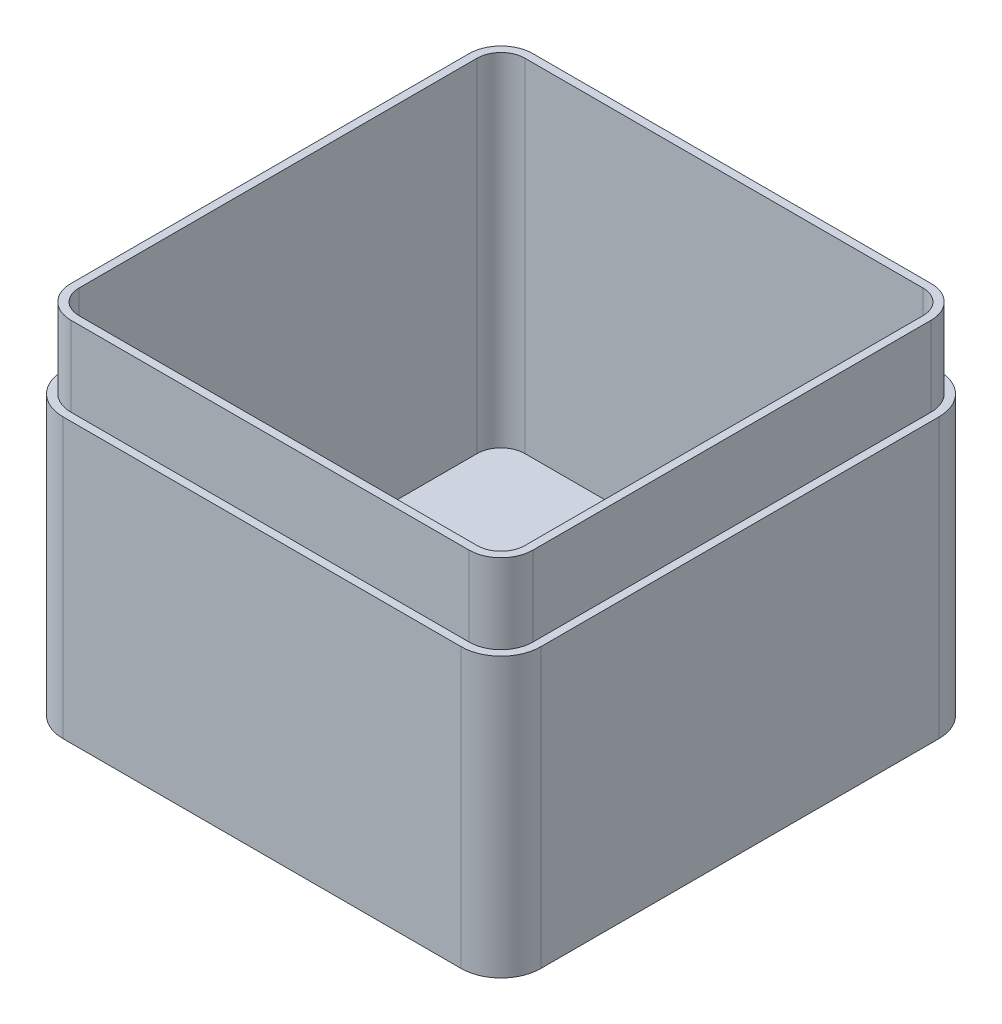
ISO-10303-21;
HEADER;
FILE_DESCRIPTION(('STEP AP214'),'2;1');
FILE_NAME('part.step','',(''),(''),'','','');
FILE_SCHEMA(('AUTOMOTIVE_DESIGN { 1 0 10303 214 1 1 1 1 }'));
ENDSEC;
DATA;
#1=APPLICATION_CONTEXT('core data for automotive mechanical design processes');
#2=APPLICATION_PROTOCOL_DEFINITION('international standard','automotive_design',2000,#1);
#3=PRODUCT_CONTEXT('',#1,'mechanical');
#4=PRODUCT('Part','Part','',(#3));
#5=PRODUCT_RELATED_PRODUCT_CATEGORY('part','',(#4));
#6=PRODUCT_DEFINITION_FORMATION('','',#4);
#7=PRODUCT_DEFINITION_CONTEXT('part definition',#1,'design');
#8=PRODUCT_DEFINITION('design','',#6,#7);
#9=PRODUCT_DEFINITION_SHAPE('','',#8);
#10=(LENGTH_UNIT() NAMED_UNIT(*) SI_UNIT(.MILLI.,.METRE.));
#11=(NAMED_UNIT(*) PLANE_ANGLE_UNIT() SI_UNIT($,.RADIAN.));
#12=(NAMED_UNIT(*) SI_UNIT($,.STERADIAN.) SOLID_ANGLE_UNIT());
#13=UNCERTAINTY_MEASURE_WITH_UNIT(LENGTH_MEASURE(1.E-05),#10,'distance_accuracy_value','');
#14=(GEOMETRIC_REPRESENTATION_CONTEXT(3) GLOBAL_UNCERTAINTY_ASSIGNED_CONTEXT((#13)) GLOBAL_UNIT_ASSIGNED_CONTEXT((#10,
#11,#12)) REPRESENTATION_CONTEXT('',''));
#15=CARTESIAN_POINT('',(0.,0.,0.));
#16=DIRECTION('',(0.,0.,1.));
#17=DIRECTION('',(1.,0.,0.));
#18=AXIS2_PLACEMENT_3D('',#15,#16,#17);
#19=CARTESIAN_POINT('',(0.,90.,0.));
#20=DIRECTION('',(0.,-1.,0.));
#21=DIRECTION('',(0.,0.,-1.));
#22=AXIS2_PLACEMENT_3D('',#19,#20,#21);
#23=PLANE('',#22);
#24=DIRECTION('',(-1.,0.,0.));
#25=VECTOR('',#24,1.);
#26=CARTESIAN_POINT('',(0.,90.,-56.));
#27=LINE('',#26,#25);
#28=CARTESIAN_POINT('',(50.,90.,-56.));
#29=VERTEX_POINT('',#28);
#30=CARTESIAN_POINT('',(-50.,90.,-56.));
#31=VERTEX_POINT('',#30);
#32=EDGE_CURVE('E343',#29,#31,#27,.T.);
#33=ORIENTED_EDGE('',*,*,#32,.F.);
#34=CARTESIAN_POINT('',(50.,90.,-50.));
#35=DIRECTION('',(0.,-1.,0.));
#36=DIRECTION('',(0.,0.,-1.));
#37=AXIS2_PLACEMENT_3D('',#34,#35,#36);
#38=CIRCLE('',#37,6.);
#39=CARTESIAN_POINT('',(56.,90.,-50.));
#40=VERTEX_POINT('',#39);
#41=EDGE_CURVE('E344',#40,#29,#38,.F.);
#42=ORIENTED_EDGE('',*,*,#41,.F.);
#43=DIRECTION('',(0.,0.,-1.));
#44=VECTOR('',#43,1.);
#45=CARTESIAN_POINT('',(56.,90.,0.));
#46=LINE('',#45,#44);
#47=CARTESIAN_POINT('',(56.,90.,50.));
#48=VERTEX_POINT('',#47);
#49=EDGE_CURVE('E324',#48,#40,#46,.T.);
#50=ORIENTED_EDGE('',*,*,#49,.F.);
#51=CARTESIAN_POINT('',(50.,90.,50.));
#52=DIRECTION('',(0.,-1.,0.));
#53=DIRECTION('',(0.,0.,-1.));
#54=AXIS2_PLACEMENT_3D('',#51,#52,#53);
#55=CIRCLE('',#54,6.);
#56=CARTESIAN_POINT('',(50.,90.,56.));
#57=VERTEX_POINT('',#56);
#58=EDGE_CURVE('E346',#57,#48,#55,.F.);
#59=ORIENTED_EDGE('',*,*,#58,.F.);
#60=DIRECTION('',(1.,0.,0.));
#61=VECTOR('',#60,1.);
#62=CARTESIAN_POINT('',(0.,90.,56.));
#63=LINE('',#62,#61);
#64=CARTESIAN_POINT('',(-50.,90.,56.));
#65=VERTEX_POINT('',#64);
#66=EDGE_CURVE('E336',#65,#57,#63,.T.);
#67=ORIENTED_EDGE('',*,*,#66,.F.);
#68=CARTESIAN_POINT('',(-50.,90.,50.));
#69=DIRECTION('',(0.,-1.,0.));
#70=DIRECTION('',(0.,0.,-1.));
#71=AXIS2_PLACEMENT_3D('',#68,#69,#70);
#72=CIRCLE('',#71,6.);
#73=CARTESIAN_POINT('',(-56.,90.,50.));
#74=VERTEX_POINT('',#73);
#75=EDGE_CURVE('E329',#74,#65,#72,.F.);
#76=ORIENTED_EDGE('',*,*,#75,.F.);
#77=DIRECTION('',(0.,0.,1.));
#78=VECTOR('',#77,1.);
#79=CARTESIAN_POINT('',(-56.,90.,0.));
#80=LINE('',#79,#78);
#81=CARTESIAN_POINT('',(-56.,90.,-50.));
#82=VERTEX_POINT('',#81);
#83=EDGE_CURVE('E349',#82,#74,#80,.T.);
#84=ORIENTED_EDGE('',*,*,#83,.F.);
#85=CARTESIAN_POINT('',(-50.,90.,-50.));
#86=DIRECTION('',(0.,-1.,0.));
#87=DIRECTION('',(0.,0.,-1.));
#88=AXIS2_PLACEMENT_3D('',#85,#86,#87);
#89=CIRCLE('',#88,6.);
#90=EDGE_CURVE('E307',#31,#82,#89,.F.);
#91=ORIENTED_EDGE('',*,*,#90,.F.);
#92=EDGE_LOOP('',(#33,#42,#50,#59,#67,#76,#84,#91));
#93=FACE_BOUND('',#92,.T.);
#94=CARTESIAN_POINT('',(50.,90.,-50.));
#95=DIRECTION('',(0.,1.,0.));
#96=DIRECTION('',(0.,0.,1.));
#97=AXIS2_PLACEMENT_3D('',#94,#95,#96);
#98=CIRCLE('',#97,8.);
#99=CARTESIAN_POINT('',(58.,90.,-50.));
#100=VERTEX_POINT('',#99);
#101=CARTESIAN_POINT('',(50.,90.,-58.));
#102=VERTEX_POINT('',#101);
#103=EDGE_CURVE('E254',#100,#102,#98,.T.);
#104=ORIENTED_EDGE('',*,*,#103,.T.);
#105=DIRECTION('',(-1.,0.,0.));
#106=VECTOR('',#105,1.);
#107=CARTESIAN_POINT('',(50.,90.,-58.));
#108=LINE('',#107,#106);
#109=CARTESIAN_POINT('',(-50.,90.,-58.));
#110=VERTEX_POINT('',#109);
#111=EDGE_CURVE('E214',#102,#110,#108,.T.);
#112=ORIENTED_EDGE('',*,*,#111,.T.);
#113=CARTESIAN_POINT('',(-50.,90.,-50.));
#114=DIRECTION('',(0.,1.,0.));
#115=DIRECTION('',(0.,0.,1.));
#116=AXIS2_PLACEMENT_3D('',#113,#114,#115);
#117=CIRCLE('',#116,7.99999999999999);
#118=CARTESIAN_POINT('',(-58.,90.,-50.));
#119=VERTEX_POINT('',#118);
#120=EDGE_CURVE('E62',#110,#119,#117,.T.);
#121=ORIENTED_EDGE('',*,*,#120,.T.);
#122=DIRECTION('',(0.,0.,1.));
#123=VECTOR('',#122,1.);
#124=CARTESIAN_POINT('',(-58.,90.,-50.));
#125=LINE('',#124,#123);
#126=CARTESIAN_POINT('',(-58.,90.,50.));
#127=VERTEX_POINT('',#126);
#128=EDGE_CURVE('E258',#119,#127,#125,.T.);
#129=ORIENTED_EDGE('',*,*,#128,.T.);
#130=CARTESIAN_POINT('',(-50.,90.,50.));
#131=DIRECTION('',(0.,1.,0.));
#132=DIRECTION('',(0.,0.,1.));
#133=AXIS2_PLACEMENT_3D('',#130,#131,#132);
#134=CIRCLE('',#133,8.);
#135=CARTESIAN_POINT('',(-50.,90.,58.));
#136=VERTEX_POINT('',#135);
#137=EDGE_CURVE('E261',#127,#136,#134,.T.);
#138=ORIENTED_EDGE('',*,*,#137,.T.);
#139=DIRECTION('',(1.,0.,0.));
#140=VECTOR('',#139,1.);
#141=CARTESIAN_POINT('',(-50.,90.,58.));
#142=LINE('',#141,#140);
#143=CARTESIAN_POINT('',(50.,90.,58.));
#144=VERTEX_POINT('',#143);
#145=EDGE_CURVE('E264',#136,#144,#142,.T.);
#146=ORIENTED_EDGE('',*,*,#145,.T.);
#147=CARTESIAN_POINT('',(50.,90.,50.));
#148=DIRECTION('',(0.,1.,0.));
#149=DIRECTION('',(0.,0.,1.));
#150=AXIS2_PLACEMENT_3D('',#147,#148,#149);
#151=CIRCLE('',#150,8.);
#152=CARTESIAN_POINT('',(58.,90.,50.));
#153=VERTEX_POINT('',#152);
#154=EDGE_CURVE('E237',#144,#153,#151,.T.);
#155=ORIENTED_EDGE('',*,*,#154,.T.);
#156=DIRECTION('',(0.,0.,-1.));
#157=VECTOR('',#156,1.);
#158=CARTESIAN_POINT('',(58.,90.,50.));
#159=LINE('',#158,#157);
#160=EDGE_CURVE('E234',#153,#100,#159,.T.);
#161=ORIENTED_EDGE('',*,*,#160,.T.);
#162=EDGE_LOOP('',(#104,#112,#121,#129,#138,#146,#155,#161));
#163=FACE_BOUND('',#162,.T.);
#164=ADVANCED_FACE('F47',(#93,#163),#23,.F.);
#165=CARTESIAN_POINT('',(56.,90.,60.));
#166=DIRECTION('',(-1.,0.,0.));
#167=DIRECTION('',(0.,0.,1.));
#168=AXIS2_PLACEMENT_3D('',#165,#166,#167);
#169=PLANE('',#168);
#170=DIRECTION('',(0.,0.,-1.));
#171=VECTOR('',#170,1.);
#172=CARTESIAN_POINT('',(56.,4.,0.));
#173=LINE('',#172,#171);
#174=CARTESIAN_POINT('',(56.,4.,50.));
#175=VERTEX_POINT('',#174);
#176=CARTESIAN_POINT('',(56.,4.,-50.));
#177=VERTEX_POINT('',#176);
#178=EDGE_CURVE('E296',#175,#177,#173,.T.);
#179=ORIENTED_EDGE('',*,*,#178,.F.);
#180=DIRECTION('',(0.,1.,0.));
#181=VECTOR('',#180,1.);
#182=CARTESIAN_POINT('',(56.,90.,50.));
#183=LINE('',#182,#181);
#184=EDGE_CURVE('E304',#48,#175,#183,.F.);
#185=ORIENTED_EDGE('',*,*,#184,.F.);
#186=ORIENTED_EDGE('',*,*,#49,.T.);
#187=DIRECTION('',(0.,1.,0.));
#188=VECTOR('',#187,1.);
#189=CARTESIAN_POINT('',(56.,90.,-50.));
#190=LINE('',#189,#188);
#191=EDGE_CURVE('E300',#177,#40,#190,.T.);
#192=ORIENTED_EDGE('',*,*,#191,.F.);
#193=EDGE_LOOP('',(#179,#185,#186,#192));
#194=FACE_BOUND('',#193,.T.);
#195=ADVANCED_FACE('F440',(#194),#169,.T.);
#196=CARTESIAN_POINT('',(-60.,90.,-56.));
#197=DIRECTION('',(0.,0.,1.));
#198=DIRECTION('',(1.,0.,0.));
#199=AXIS2_PLACEMENT_3D('',#196,#197,#198);
#200=PLANE('',#199);
#201=DIRECTION('',(-1.,0.,0.));
#202=VECTOR('',#201,1.);
#203=CARTESIAN_POINT('',(0.,4.,-56.));
#204=LINE('',#203,#202);
#205=CARTESIAN_POINT('',(50.,4.,-56.));
#206=VERTEX_POINT('',#205);
#207=CARTESIAN_POINT('',(-50.,4.,-56.));
#208=VERTEX_POINT('',#207);
#209=EDGE_CURVE('E299',#206,#208,#204,.T.);
#210=ORIENTED_EDGE('',*,*,#209,.F.);
#211=DIRECTION('',(0.,1.,0.));
#212=VECTOR('',#211,1.);
#213=CARTESIAN_POINT('',(50.,90.,-56.));
#214=LINE('',#213,#212);
#215=EDGE_CURVE('E314',#29,#206,#214,.F.);
#216=ORIENTED_EDGE('',*,*,#215,.F.);
#217=ORIENTED_EDGE('',*,*,#32,.T.);
#218=DIRECTION('',(0.,1.,0.));
#219=VECTOR('',#218,1.);
#220=CARTESIAN_POINT('',(-50.,90.,-56.));
#221=LINE('',#220,#219);
#222=EDGE_CURVE('E327',#208,#31,#221,.T.);
#223=ORIENTED_EDGE('',*,*,#222,.F.);
#224=EDGE_LOOP('',(#210,#216,#217,#223));
#225=FACE_BOUND('',#224,.T.);
#226=ADVANCED_FACE('F448',(#225),#200,.T.);
#227=CARTESIAN_POINT('',(-56.,90.,60.));
#228=DIRECTION('',(1.,0.,0.));
#229=DIRECTION('',(0.,0.,-1.));
#230=AXIS2_PLACEMENT_3D('',#227,#228,#229);
#231=PLANE('',#230);
#232=ORIENTED_EDGE('',*,*,#83,.T.);
#233=DIRECTION('',(0.,1.,0.));
#234=VECTOR('',#233,1.);
#235=CARTESIAN_POINT('',(-56.,90.,50.));
#236=LINE('',#235,#234);
#237=CARTESIAN_POINT('',(-56.,4.,50.));
#238=VERTEX_POINT('',#237);
#239=EDGE_CURVE('E334',#238,#74,#236,.T.);
#240=ORIENTED_EDGE('',*,*,#239,.F.);
#241=DIRECTION('',(0.,0.,1.));
#242=VECTOR('',#241,1.);
#243=CARTESIAN_POINT('',(-56.,4.,0.));
#244=LINE('',#243,#242);
#245=CARTESIAN_POINT('',(-56.,4.,-50.));
#246=VERTEX_POINT('',#245);
#247=EDGE_CURVE('E308',#246,#238,#244,.T.);
#248=ORIENTED_EDGE('',*,*,#247,.F.);
#249=DIRECTION('',(0.,1.,0.));
#250=VECTOR('',#249,1.);
#251=CARTESIAN_POINT('',(-56.,90.,-50.));
#252=LINE('',#251,#250);
#253=EDGE_CURVE('E326',#82,#246,#252,.F.);
#254=ORIENTED_EDGE('',*,*,#253,.F.);
#255=EDGE_LOOP('',(#232,#240,#248,#254));
#256=FACE_BOUND('',#255,.T.);
#257=ADVANCED_FACE('F567',(#256),#231,.T.);
#258=CARTESIAN_POINT('',(-60.,90.,56.));
#259=DIRECTION('',(0.,0.,-1.));
#260=DIRECTION('',(-1.,0.,0.));
#261=AXIS2_PLACEMENT_3D('',#258,#259,#260);
#262=PLANE('',#261);
#263=DIRECTION('',(1.,0.,0.));
#264=VECTOR('',#263,1.);
#265=CARTESIAN_POINT('',(0.,4.,56.));
#266=LINE('',#265,#264);
#267=CARTESIAN_POINT('',(-50.,4.,56.));
#268=VERTEX_POINT('',#267);
#269=CARTESIAN_POINT('',(50.,4.,56.));
#270=VERTEX_POINT('',#269);
#271=EDGE_CURVE('E311',#268,#270,#266,.T.);
#272=ORIENTED_EDGE('',*,*,#271,.F.);
#273=DIRECTION('',(0.,1.,0.));
#274=VECTOR('',#273,1.);
#275=CARTESIAN_POINT('',(-50.,90.,56.));
#276=LINE('',#275,#274);
#277=EDGE_CURVE('E303',#65,#268,#276,.F.);
#278=ORIENTED_EDGE('',*,*,#277,.F.);
#279=ORIENTED_EDGE('',*,*,#66,.T.);
#280=DIRECTION('',(0.,1.,0.));
#281=VECTOR('',#280,1.);
#282=CARTESIAN_POINT('',(50.,90.,56.));
#283=LINE('',#282,#281);
#284=EDGE_CURVE('E339',#270,#57,#283,.T.);
#285=ORIENTED_EDGE('',*,*,#284,.F.);
#286=EDGE_LOOP('',(#272,#278,#279,#285));
#287=FACE_BOUND('',#286,.T.);
#288=ADVANCED_FACE('F571',(#287),#262,.T.);
#289=CARTESIAN_POINT('',(0.,4.,0.));
#290=DIRECTION('',(0.,-1.,0.));
#291=DIRECTION('',(0.,0.,-1.));
#292=AXIS2_PLACEMENT_3D('',#289,#290,#291);
#293=PLANE('',#292);
#294=ORIENTED_EDGE('',*,*,#247,.T.);
#295=CARTESIAN_POINT('',(-50.,4.,50.));
#296=DIRECTION('',(0.,-1.,0.));
#297=DIRECTION('',(0.,0.,-1.));
#298=AXIS2_PLACEMENT_3D('',#295,#296,#297);
#299=CIRCLE('',#298,6.);
#300=EDGE_CURVE('E321',#268,#238,#299,.T.);
#301=ORIENTED_EDGE('',*,*,#300,.F.);
#302=ORIENTED_EDGE('',*,*,#271,.T.);
#303=CARTESIAN_POINT('',(50.,4.,50.));
#304=DIRECTION('',(0.,-1.,0.));
#305=DIRECTION('',(0.,0.,-1.));
#306=AXIS2_PLACEMENT_3D('',#303,#304,#305);
#307=CIRCLE('',#306,6.);
#308=EDGE_CURVE('E319',#175,#270,#307,.T.);
#309=ORIENTED_EDGE('',*,*,#308,.F.);
#310=ORIENTED_EDGE('',*,*,#178,.T.);
#311=CARTESIAN_POINT('',(50.,4.,-50.));
#312=DIRECTION('',(0.,-1.,0.));
#313=DIRECTION('',(0.,0.,-1.));
#314=AXIS2_PLACEMENT_3D('',#311,#312,#313);
#315=CIRCLE('',#314,6.);
#316=EDGE_CURVE('E315',#206,#177,#315,.T.);
#317=ORIENTED_EDGE('',*,*,#316,.F.);
#318=ORIENTED_EDGE('',*,*,#209,.T.);
#319=CARTESIAN_POINT('',(-50.,4.,-50.));
#320=DIRECTION('',(0.,-1.,0.));
#321=DIRECTION('',(0.,0.,-1.));
#322=AXIS2_PLACEMENT_3D('',#319,#320,#321);
#323=CIRCLE('',#322,6.);
#324=EDGE_CURVE('E312',#246,#208,#323,.T.);
#325=ORIENTED_EDGE('',*,*,#324,.F.);
#326=EDGE_LOOP('',(#294,#301,#302,#309,#310,#317,#318,#325));
#327=FACE_BOUND('',#326,.T.);
#328=ADVANCED_FACE('F575',(#327),#293,.F.);
#329=CARTESIAN_POINT('',(-50.,90.,-50.));
#330=DIRECTION('',(0.,-1.,0.));
#331=DIRECTION('',(0.,0.,-1.));
#332=AXIS2_PLACEMENT_3D('',#329,#330,#331);
#333=CYLINDRICAL_SURFACE('',#332,6.);
#334=ORIENTED_EDGE('',*,*,#90,.T.);
#335=ORIENTED_EDGE('',*,*,#253,.T.);
#336=ORIENTED_EDGE('',*,*,#324,.T.);
#337=ORIENTED_EDGE('',*,*,#222,.T.);
#338=EDGE_LOOP('',(#334,#335,#336,#337));
#339=FACE_BOUND('',#338,.T.);
#340=ADVANCED_FACE('F579',(#339),#333,.F.);
#341=CARTESIAN_POINT('',(50.,90.,-50.));
#342=DIRECTION('',(0.,-1.,0.));
#343=DIRECTION('',(0.,0.,-1.));
#344=AXIS2_PLACEMENT_3D('',#341,#342,#343);
#345=CYLINDRICAL_SURFACE('',#344,6.);
#346=ORIENTED_EDGE('',*,*,#41,.T.);
#347=ORIENTED_EDGE('',*,*,#215,.T.);
#348=ORIENTED_EDGE('',*,*,#316,.T.);
#349=ORIENTED_EDGE('',*,*,#191,.T.);
#350=EDGE_LOOP('',(#346,#347,#348,#349));
#351=FACE_BOUND('',#350,.T.);
#352=ADVANCED_FACE('F583',(#351),#345,.F.);
#353=CARTESIAN_POINT('',(50.,90.,50.));
#354=DIRECTION('',(0.,-1.,0.));
#355=DIRECTION('',(0.,0.,-1.));
#356=AXIS2_PLACEMENT_3D('',#353,#354,#355);
#357=CYLINDRICAL_SURFACE('',#356,6.);
#358=ORIENTED_EDGE('',*,*,#58,.T.);
#359=ORIENTED_EDGE('',*,*,#184,.T.);
#360=ORIENTED_EDGE('',*,*,#308,.T.);
#361=ORIENTED_EDGE('',*,*,#284,.T.);
#362=EDGE_LOOP('',(#358,#359,#360,#361));
#363=FACE_BOUND('',#362,.T.);
#364=ADVANCED_FACE('F586',(#363),#357,.F.);
#365=CARTESIAN_POINT('',(-50.,90.,50.));
#366=DIRECTION('',(0.,-1.,0.));
#367=DIRECTION('',(0.,0.,-1.));
#368=AXIS2_PLACEMENT_3D('',#365,#366,#367);
#369=CYLINDRICAL_SURFACE('',#368,6.);
#370=ORIENTED_EDGE('',*,*,#75,.T.);
#371=ORIENTED_EDGE('',*,*,#277,.T.);
#372=ORIENTED_EDGE('',*,*,#300,.T.);
#373=ORIENTED_EDGE('',*,*,#239,.T.);
#374=EDGE_LOOP('',(#370,#371,#372,#373));
#375=FACE_BOUND('',#374,.T.);
#376=ADVANCED_FACE('F455',(#375),#369,.F.);
#377=CARTESIAN_POINT('',(50.,70.,-50.));
#378=DIRECTION('',(0.,1.,0.));
#379=DIRECTION('',(0.,0.,1.));
#380=AXIS2_PLACEMENT_3D('',#377,#378,#379);
#381=PLANE('',#380);
#382=DIRECTION('',(0.,0.,-1.));
#383=VECTOR('',#382,1.);
#384=CARTESIAN_POINT('',(58.,70.,50.));
#385=LINE('',#384,#383);
#386=CARTESIAN_POINT('',(58.,70.,50.));
#387=VERTEX_POINT('',#386);
#388=CARTESIAN_POINT('',(58.,70.,-50.));
#389=VERTEX_POINT('',#388);
#390=EDGE_CURVE('E220',#387,#389,#385,.T.);
#391=ORIENTED_EDGE('',*,*,#390,.F.);
#392=CARTESIAN_POINT('',(50.,70.,50.));
#393=DIRECTION('',(0.,1.,0.));
#394=DIRECTION('',(0.,0.,1.));
#395=AXIS2_PLACEMENT_3D('',#392,#393,#394);
#396=CIRCLE('',#395,8.);
#397=CARTESIAN_POINT('',(50.,70.,58.));
#398=VERTEX_POINT('',#397);
#399=EDGE_CURVE('E250',#398,#387,#396,.T.);
#400=ORIENTED_EDGE('',*,*,#399,.F.);
#401=DIRECTION('',(1.,0.,0.));
#402=VECTOR('',#401,1.);
#403=CARTESIAN_POINT('',(-50.,70.,58.));
#404=LINE('',#403,#402);
#405=CARTESIAN_POINT('',(-50.,70.,58.));
#406=VERTEX_POINT('',#405);
#407=EDGE_CURVE('E247',#406,#398,#404,.T.);
#408=ORIENTED_EDGE('',*,*,#407,.F.);
#409=CARTESIAN_POINT('',(-50.,70.,50.));
#410=DIRECTION('',(0.,1.,0.));
#411=DIRECTION('',(0.,0.,1.));
#412=AXIS2_PLACEMENT_3D('',#409,#410,#411);
#413=CIRCLE('',#412,8.);
#414=CARTESIAN_POINT('',(-58.,70.,50.));
#415=VERTEX_POINT('',#414);
#416=EDGE_CURVE('E244',#415,#406,#413,.T.);
#417=ORIENTED_EDGE('',*,*,#416,.F.);
#418=DIRECTION('',(0.,0.,1.));
#419=VECTOR('',#418,1.);
#420=CARTESIAN_POINT('',(-58.,70.,-50.));
#421=LINE('',#420,#419);
#422=CARTESIAN_POINT('',(-58.,70.,-50.));
#423=VERTEX_POINT('',#422);
#424=EDGE_CURVE('E241',#423,#415,#421,.T.);
#425=ORIENTED_EDGE('',*,*,#424,.F.);
#426=CARTESIAN_POINT('',(-50.,70.,-50.));
#427=DIRECTION('',(0.,1.,0.));
#428=DIRECTION('',(0.,0.,1.));
#429=AXIS2_PLACEMENT_3D('',#426,#427,#428);
#430=CIRCLE('',#429,7.99999999999999);
#431=CARTESIAN_POINT('',(-50.,70.,-58.));
#432=VERTEX_POINT('',#431);
#433=EDGE_CURVE('E230',#432,#423,#430,.T.);
#434=ORIENTED_EDGE('',*,*,#433,.F.);
#435=DIRECTION('',(-1.,0.,0.));
#436=VECTOR('',#435,1.);
#437=CARTESIAN_POINT('',(50.,70.,-58.));
#438=LINE('',#437,#436);
#439=CARTESIAN_POINT('',(50.,70.,-58.));
#440=VERTEX_POINT('',#439);
#441=EDGE_CURVE('E212',#440,#432,#438,.T.);
#442=ORIENTED_EDGE('',*,*,#441,.F.);
#443=CARTESIAN_POINT('',(50.,70.,-50.));
#444=DIRECTION('',(0.,1.,0.));
#445=DIRECTION('',(0.,0.,1.));
#446=AXIS2_PLACEMENT_3D('',#443,#444,#445);
#447=CIRCLE('',#446,8.);
#448=EDGE_CURVE('E226',#389,#440,#447,.T.);
#449=ORIENTED_EDGE('',*,*,#448,.F.);
#450=EDGE_LOOP('',(#391,#400,#408,#417,#425,#434,#442,#449));
#451=FACE_BOUND('',#450,.T.);
#452=CARTESIAN_POINT('',(50.,70.,-50.));
#453=DIRECTION('',(0.,1.,0.));
#454=DIRECTION('',(0.,0.,1.));
#455=AXIS2_PLACEMENT_3D('',#452,#453,#454);
#456=CIRCLE('',#455,10.);
#457=CARTESIAN_POINT('',(60.,70.,-50.));
#458=VERTEX_POINT('',#457);
#459=CARTESIAN_POINT('',(50.,70.,-60.));
#460=VERTEX_POINT('',#459);
#461=EDGE_CURVE('E270',#458,#460,#456,.T.);
#462=ORIENTED_EDGE('',*,*,#461,.T.);
#463=DIRECTION('',(-1.,0.,0.));
#464=VECTOR('',#463,1.);
#465=CARTESIAN_POINT('',(50.,70.,-60.));
#466=LINE('',#465,#464);
#467=CARTESIAN_POINT('',(-50.,70.,-60.));
#468=VERTEX_POINT('',#467);
#469=EDGE_CURVE('E283',#460,#468,#466,.T.);
#470=ORIENTED_EDGE('',*,*,#469,.T.);
#471=CARTESIAN_POINT('',(-50.,70.,-50.));
#472=DIRECTION('',(0.,1.,0.));
#473=DIRECTION('',(0.,0.,1.));
#474=AXIS2_PLACEMENT_3D('',#471,#472,#473);
#475=CIRCLE('',#474,9.99999999999999);
#476=CARTESIAN_POINT('',(-60.,70.,-50.));
#477=VERTEX_POINT('',#476);
#478=EDGE_CURVE('E285',#468,#477,#475,.T.);
#479=ORIENTED_EDGE('',*,*,#478,.T.);
#480=DIRECTION('',(0.,0.,1.));
#481=VECTOR('',#480,1.);
#482=CARTESIAN_POINT('',(-60.,70.,-50.));
#483=LINE('',#482,#481);
#484=CARTESIAN_POINT('',(-60.,70.,50.));
#485=VERTEX_POINT('',#484);
#486=EDGE_CURVE('E70',#477,#485,#483,.T.);
#487=ORIENTED_EDGE('',*,*,#486,.T.);
#488=CARTESIAN_POINT('',(-50.,70.,50.));
#489=DIRECTION('',(0.,1.,0.));
#490=DIRECTION('',(0.,0.,1.));
#491=AXIS2_PLACEMENT_3D('',#488,#489,#490);
#492=CIRCLE('',#491,9.99999999999999);
#493=CARTESIAN_POINT('',(-50.,70.,60.));
#494=VERTEX_POINT('',#493);
#495=EDGE_CURVE('E288',#485,#494,#492,.T.);
#496=ORIENTED_EDGE('',*,*,#495,.T.);
#497=DIRECTION('',(1.,0.,0.));
#498=VECTOR('',#497,1.);
#499=CARTESIAN_POINT('',(-50.,70.,60.));
#500=LINE('',#499,#498);
#501=CARTESIAN_POINT('',(50.,70.,60.));
#502=VERTEX_POINT('',#501);
#503=EDGE_CURVE('E290',#494,#502,#500,.T.);
#504=ORIENTED_EDGE('',*,*,#503,.T.);
#505=CARTESIAN_POINT('',(50.,70.,50.));
#506=DIRECTION('',(0.,1.,0.));
#507=DIRECTION('',(0.,0.,1.));
#508=AXIS2_PLACEMENT_3D('',#505,#506,#507);
#509=CIRCLE('',#508,10.);
#510=CARTESIAN_POINT('',(60.,70.,50.));
#511=VERTEX_POINT('',#510);
#512=EDGE_CURVE('E292',#502,#511,#509,.T.);
#513=ORIENTED_EDGE('',*,*,#512,.T.);
#514=DIRECTION('',(0.,0.,-1.));
#515=VECTOR('',#514,1.);
#516=CARTESIAN_POINT('',(60.,70.,50.));
#517=LINE('',#516,#515);
#518=EDGE_CURVE('E294',#511,#458,#517,.T.);
#519=ORIENTED_EDGE('',*,*,#518,.T.);
#520=EDGE_LOOP('',(#462,#470,#479,#487,#496,#504,#513,#519));
#521=FACE_BOUND('',#520,.T.);
#522=ADVANCED_FACE('F225',(#451,#521),#381,.T.);
#523=CARTESIAN_POINT('',(50.,70.,-50.));
#524=DIRECTION('',(0.,1.,0.));
#525=DIRECTION('',(0.,0.,1.));
#526=AXIS2_PLACEMENT_3D('',#523,#524,#525);
#527=CYLINDRICAL_SURFACE('',#526,8.);
#528=ORIENTED_EDGE('',*,*,#103,.F.);
#529=DIRECTION('',(0.,1.,0.));
#530=VECTOR('',#529,1.);
#531=CARTESIAN_POINT('',(58.,70.,-50.));
#532=LINE('',#531,#530);
#533=EDGE_CURVE('E233',#389,#100,#532,.T.);
#534=ORIENTED_EDGE('',*,*,#533,.F.);
#535=ORIENTED_EDGE('',*,*,#448,.T.);
#536=DIRECTION('',(0.,1.,0.));
#537=VECTOR('',#536,1.);
#538=CARTESIAN_POINT('',(50.,70.,-58.));
#539=LINE('',#538,#537);
#540=EDGE_CURVE('E209',#440,#102,#539,.T.);
#541=ORIENTED_EDGE('',*,*,#540,.T.);
#542=EDGE_LOOP('',(#528,#534,#535,#541));
#543=FACE_BOUND('',#542,.T.);
#544=ADVANCED_FACE('F232',(#543),#527,.T.);
#545=CARTESIAN_POINT('',(58.,70.,50.));
#546=DIRECTION('',(1.,0.,0.));
#547=DIRECTION('',(0.,0.,-1.));
#548=AXIS2_PLACEMENT_3D('',#545,#546,#547);
#549=PLANE('',#548);
#550=ORIENTED_EDGE('',*,*,#160,.F.);
#551=DIRECTION('',(0.,1.,0.));
#552=VECTOR('',#551,1.);
#553=CARTESIAN_POINT('',(58.,70.,50.));
#554=LINE('',#553,#552);
#555=EDGE_CURVE('E271',#387,#153,#554,.T.);
#556=ORIENTED_EDGE('',*,*,#555,.F.);
#557=ORIENTED_EDGE('',*,*,#390,.T.);
#558=ORIENTED_EDGE('',*,*,#533,.T.);
#559=EDGE_LOOP('',(#550,#556,#557,#558));
#560=FACE_BOUND('',#559,.T.);
#561=ADVANCED_FACE('F494',(#560),#549,.T.);
#562=CARTESIAN_POINT('',(50.,70.,50.));
#563=DIRECTION('',(0.,1.,0.));
#564=DIRECTION('',(0.,0.,1.));
#565=AXIS2_PLACEMENT_3D('',#562,#563,#564);
#566=CYLINDRICAL_SURFACE('',#565,8.);
#567=ORIENTED_EDGE('',*,*,#154,.F.);
#568=DIRECTION('',(0.,1.,0.));
#569=VECTOR('',#568,1.);
#570=CARTESIAN_POINT('',(50.,70.,58.));
#571=LINE('',#570,#569);
#572=EDGE_CURVE('E273',#398,#144,#571,.T.);
#573=ORIENTED_EDGE('',*,*,#572,.F.);
#574=ORIENTED_EDGE('',*,*,#399,.T.);
#575=ORIENTED_EDGE('',*,*,#555,.T.);
#576=EDGE_LOOP('',(#567,#573,#574,#575));
#577=FACE_BOUND('',#576,.T.);
#578=ADVANCED_FACE('F502',(#577),#566,.T.);
#579=CARTESIAN_POINT('',(-50.,70.,58.));
#580=DIRECTION('',(0.,0.,1.));
#581=DIRECTION('',(1.,0.,0.));
#582=AXIS2_PLACEMENT_3D('',#579,#580,#581);
#583=PLANE('',#582);
#584=ORIENTED_EDGE('',*,*,#145,.F.);
#585=DIRECTION('',(0.,1.,0.));
#586=VECTOR('',#585,1.);
#587=CARTESIAN_POINT('',(-50.,70.,58.));
#588=LINE('',#587,#586);
#589=EDGE_CURVE('E275',#406,#136,#588,.T.);
#590=ORIENTED_EDGE('',*,*,#589,.F.);
#591=ORIENTED_EDGE('',*,*,#407,.T.);
#592=ORIENTED_EDGE('',*,*,#572,.T.);
#593=EDGE_LOOP('',(#584,#590,#591,#592));
#594=FACE_BOUND('',#593,.T.);
#595=ADVANCED_FACE('F511',(#594),#583,.T.);
#596=CARTESIAN_POINT('',(-50.,70.,50.));
#597=DIRECTION('',(0.,1.,0.));
#598=DIRECTION('',(0.,0.,1.));
#599=AXIS2_PLACEMENT_3D('',#596,#597,#598);
#600=CYLINDRICAL_SURFACE('',#599,8.);
#601=ORIENTED_EDGE('',*,*,#137,.F.);
#602=DIRECTION('',(0.,1.,0.));
#603=VECTOR('',#602,1.);
#604=CARTESIAN_POINT('',(-58.,70.,50.));
#605=LINE('',#604,#603);
#606=EDGE_CURVE('E277',#415,#127,#605,.T.);
#607=ORIENTED_EDGE('',*,*,#606,.F.);
#608=ORIENTED_EDGE('',*,*,#416,.T.);
#609=ORIENTED_EDGE('',*,*,#589,.T.);
#610=EDGE_LOOP('',(#601,#607,#608,#609));
#611=FACE_BOUND('',#610,.T.);
#612=ADVANCED_FACE('F520',(#611),#600,.T.);
#613=CARTESIAN_POINT('',(-58.,70.,-50.));
#614=DIRECTION('',(-1.,0.,0.));
#615=DIRECTION('',(0.,0.,1.));
#616=AXIS2_PLACEMENT_3D('',#613,#614,#615);
#617=PLANE('',#616);
#618=ORIENTED_EDGE('',*,*,#128,.F.);
#619=DIRECTION('',(0.,1.,0.));
#620=VECTOR('',#619,1.);
#621=CARTESIAN_POINT('',(-58.,70.,-50.));
#622=LINE('',#621,#620);
#623=EDGE_CURVE('E279',#423,#119,#622,.T.);
#624=ORIENTED_EDGE('',*,*,#623,.F.);
#625=ORIENTED_EDGE('',*,*,#424,.T.);
#626=ORIENTED_EDGE('',*,*,#606,.T.);
#627=EDGE_LOOP('',(#618,#624,#625,#626));
#628=FACE_BOUND('',#627,.T.);
#629=ADVANCED_FACE('F529',(#628),#617,.T.);
#630=CARTESIAN_POINT('',(-50.,70.,-50.));
#631=DIRECTION('',(0.,1.,0.));
#632=DIRECTION('',(0.,0.,1.));
#633=AXIS2_PLACEMENT_3D('',#630,#631,#632);
#634=CYLINDRICAL_SURFACE('',#633,7.99999999999999);
#635=ORIENTED_EDGE('',*,*,#120,.F.);
#636=DIRECTION('',(0.,1.,0.));
#637=VECTOR('',#636,1.);
#638=CARTESIAN_POINT('',(-50.,70.,-58.));
#639=LINE('',#638,#637);
#640=EDGE_CURVE('E219',#432,#110,#639,.T.);
#641=ORIENTED_EDGE('',*,*,#640,.F.);
#642=ORIENTED_EDGE('',*,*,#433,.T.);
#643=ORIENTED_EDGE('',*,*,#623,.T.);
#644=EDGE_LOOP('',(#635,#641,#642,#643));
#645=FACE_BOUND('',#644,.T.);
#646=ADVANCED_FACE('F538',(#645),#634,.T.);
#647=CARTESIAN_POINT('',(50.,70.,-58.));
#648=DIRECTION('',(0.,0.,-1.));
#649=DIRECTION('',(-1.,0.,0.));
#650=AXIS2_PLACEMENT_3D('',#647,#648,#649);
#651=PLANE('',#650);
#652=ORIENTED_EDGE('',*,*,#111,.F.);
#653=ORIENTED_EDGE('',*,*,#540,.F.);
#654=ORIENTED_EDGE('',*,*,#441,.T.);
#655=ORIENTED_EDGE('',*,*,#640,.T.);
#656=EDGE_LOOP('',(#652,#653,#654,#655));
#657=FACE_BOUND('',#656,.T.);
#658=ADVANCED_FACE('F211',(#657),#651,.T.);
#659=CARTESIAN_POINT('',(0.,0.,0.));
#660=DIRECTION('',(0.,-1.,0.));
#661=DIRECTION('',(0.,0.,-1.));
#662=AXIS2_PLACEMENT_3D('',#659,#660,#661);
#663=PLANE('',#662);
#664=DIRECTION('',(0.,0.,1.));
#665=VECTOR('',#664,1.);
#666=CARTESIAN_POINT('',(-60.,0.,60.));
#667=LINE('',#666,#665);
#668=CARTESIAN_POINT('',(-60.,0.,-50.));
#669=VERTEX_POINT('',#668);
#670=CARTESIAN_POINT('',(-60.,0.,50.));
#671=VERTEX_POINT('',#670);
#672=EDGE_CURVE('E362',#669,#671,#667,.T.);
#673=ORIENTED_EDGE('',*,*,#672,.F.);
#674=CARTESIAN_POINT('',(-50.,0.,-50.));
#675=DIRECTION('',(0.,-1.,0.));
#676=DIRECTION('',(0.,0.,-1.));
#677=AXIS2_PLACEMENT_3D('',#674,#675,#676);
#678=CIRCLE('',#677,10.);
#679=CARTESIAN_POINT('',(-50.,0.,-60.));
#680=VERTEX_POINT('',#679);
#681=EDGE_CURVE('E379',#669,#680,#678,.T.);
#682=ORIENTED_EDGE('',*,*,#681,.T.);
#683=DIRECTION('',(-1.,0.,0.));
#684=VECTOR('',#683,1.);
#685=CARTESIAN_POINT('',(-60.,0.,-60.));
#686=LINE('',#685,#684);
#687=CARTESIAN_POINT('',(50.,0.,-60.));
#688=VERTEX_POINT('',#687);
#689=EDGE_CURVE('E359',#688,#680,#686,.T.);
#690=ORIENTED_EDGE('',*,*,#689,.F.);
#691=CARTESIAN_POINT('',(50.,0.,-50.));
#692=DIRECTION('',(0.,-1.,0.));
#693=DIRECTION('',(0.,0.,-1.));
#694=AXIS2_PLACEMENT_3D('',#691,#692,#693);
#695=CIRCLE('',#694,10.);
#696=CARTESIAN_POINT('',(60.,0.,-50.));
#697=VERTEX_POINT('',#696);
#698=EDGE_CURVE('E377',#688,#697,#695,.T.);
#699=ORIENTED_EDGE('',*,*,#698,.T.);
#700=DIRECTION('',(0.,0.,-1.));
#701=VECTOR('',#700,1.);
#702=CARTESIAN_POINT('',(60.,0.,60.));
#703=LINE('',#702,#701);
#704=CARTESIAN_POINT('',(60.,0.,50.));
#705=VERTEX_POINT('',#704);
#706=EDGE_CURVE('E341',#705,#697,#703,.T.);
#707=ORIENTED_EDGE('',*,*,#706,.F.);
#708=CARTESIAN_POINT('',(50.,0.,50.));
#709=DIRECTION('',(0.,-1.,0.));
#710=DIRECTION('',(0.,0.,-1.));
#711=AXIS2_PLACEMENT_3D('',#708,#709,#710);
#712=CIRCLE('',#711,10.);
#713=CARTESIAN_POINT('',(50.,0.,60.));
#714=VERTEX_POINT('',#713);
#715=EDGE_CURVE('E375',#705,#714,#712,.T.);
#716=ORIENTED_EDGE('',*,*,#715,.T.);
#717=DIRECTION('',(1.,0.,0.));
#718=VECTOR('',#717,1.);
#719=CARTESIAN_POINT('',(-60.,0.,60.));
#720=LINE('',#719,#718);
#721=CARTESIAN_POINT('',(-50.,0.,60.));
#722=VERTEX_POINT('',#721);
#723=EDGE_CURVE('E365',#722,#714,#720,.T.);
#724=ORIENTED_EDGE('',*,*,#723,.F.);
#725=CARTESIAN_POINT('',(-50.,0.,50.));
#726=DIRECTION('',(0.,-1.,0.));
#727=DIRECTION('',(0.,0.,-1.));
#728=AXIS2_PLACEMENT_3D('',#725,#726,#727);
#729=CIRCLE('',#728,10.);
#730=EDGE_CURVE('E373',#722,#671,#729,.T.);
#731=ORIENTED_EDGE('',*,*,#730,.T.);
#732=EDGE_LOOP('',(#673,#682,#690,#699,#707,#716,#724,#731));
#733=FACE_BOUND('',#732,.T.);
#734=ADVANCED_FACE('F401',(#733),#663,.T.);
#735=CARTESIAN_POINT('',(50.,90.,50.));
#736=DIRECTION('',(0.,-1.,0.));
#737=DIRECTION('',(0.,0.,-1.));
#738=AXIS2_PLACEMENT_3D('',#735,#736,#737);
#739=CYLINDRICAL_SURFACE('',#738,10.);
#740=DIRECTION('',(0.,-1.,0.));
#741=VECTOR('',#740,1.);
#742=CARTESIAN_POINT('',(60.,90.,50.));
#743=LINE('',#742,#741);
#744=EDGE_CURVE('E386',#511,#705,#743,.T.);
#745=ORIENTED_EDGE('',*,*,#744,.F.);
#746=ORIENTED_EDGE('',*,*,#512,.F.);
#747=DIRECTION('',(0.,-1.,0.));
#748=VECTOR('',#747,1.);
#749=CARTESIAN_POINT('',(50.,90.,60.));
#750=LINE('',#749,#748);
#751=EDGE_CURVE('E12',#714,#502,#750,.F.);
#752=ORIENTED_EDGE('',*,*,#751,.F.);
#753=ORIENTED_EDGE('',*,*,#715,.F.);
#754=EDGE_LOOP('',(#745,#746,#752,#753));
#755=FACE_BOUND('',#754,.T.);
#756=ADVANCED_FACE('F406',(#755),#739,.T.);
#757=CARTESIAN_POINT('',(-50.,90.,50.));
#758=DIRECTION('',(0.,-1.,0.));
#759=DIRECTION('',(0.,0.,-1.));
#760=AXIS2_PLACEMENT_3D('',#757,#758,#759);
#761=CYLINDRICAL_SURFACE('',#760,10.);
#762=DIRECTION('',(0.,-1.,0.));
#763=VECTOR('',#762,1.);
#764=CARTESIAN_POINT('',(-50.,90.,60.));
#765=LINE('',#764,#763);
#766=EDGE_CURVE('E55',#494,#722,#765,.T.);
#767=ORIENTED_EDGE('',*,*,#766,.F.);
#768=ORIENTED_EDGE('',*,*,#495,.F.);
#769=DIRECTION('',(0.,-1.,0.));
#770=VECTOR('',#769,1.);
#771=CARTESIAN_POINT('',(-60.,90.,50.));
#772=LINE('',#771,#770);
#773=EDGE_CURVE('E368',#671,#485,#772,.F.);
#774=ORIENTED_EDGE('',*,*,#773,.F.);
#775=ORIENTED_EDGE('',*,*,#730,.F.);
#776=EDGE_LOOP('',(#767,#768,#774,#775));
#777=FACE_BOUND('',#776,.T.);
#778=ADVANCED_FACE('F49',(#777),#761,.T.);
#779=CARTESIAN_POINT('',(-60.,90.,60.));
#780=DIRECTION('',(0.,0.,-1.));
#781=DIRECTION('',(-1.,0.,0.));
#782=AXIS2_PLACEMENT_3D('',#779,#780,#781);
#783=PLANE('',#782);
#784=ORIENTED_EDGE('',*,*,#503,.F.);
#785=ORIENTED_EDGE('',*,*,#766,.T.);
#786=ORIENTED_EDGE('',*,*,#723,.T.);
#787=ORIENTED_EDGE('',*,*,#751,.T.);
#788=EDGE_LOOP('',(#784,#785,#786,#787));
#789=FACE_BOUND('',#788,.T.);
#790=ADVANCED_FACE('F394',(#789),#783,.F.);
#791=CARTESIAN_POINT('',(-50.,90.,-50.));
#792=DIRECTION('',(0.,-1.,0.));
#793=DIRECTION('',(0.,0.,-1.));
#794=AXIS2_PLACEMENT_3D('',#791,#792,#793);
#795=CYLINDRICAL_SURFACE('',#794,10.);
#796=DIRECTION('',(0.,-1.,0.));
#797=VECTOR('',#796,1.);
#798=CARTESIAN_POINT('',(-60.,90.,-50.));
#799=LINE('',#798,#797);
#800=EDGE_CURVE('E371',#477,#669,#799,.T.);
#801=ORIENTED_EDGE('',*,*,#800,.F.);
#802=ORIENTED_EDGE('',*,*,#478,.F.);
#803=DIRECTION('',(0.,-1.,0.));
#804=VECTOR('',#803,1.);
#805=CARTESIAN_POINT('',(-50.,90.,-60.));
#806=LINE('',#805,#804);
#807=EDGE_CURVE('E383',#680,#468,#806,.F.);
#808=ORIENTED_EDGE('',*,*,#807,.F.);
#809=ORIENTED_EDGE('',*,*,#681,.F.);
#810=EDGE_LOOP('',(#801,#802,#808,#809));
#811=FACE_BOUND('',#810,.T.);
#812=ADVANCED_FACE('F426',(#811),#795,.T.);
#813=CARTESIAN_POINT('',(-60.,90.,60.));
#814=DIRECTION('',(1.,0.,0.));
#815=DIRECTION('',(0.,0.,-1.));
#816=AXIS2_PLACEMENT_3D('',#813,#814,#815);
#817=PLANE('',#816);
#818=ORIENTED_EDGE('',*,*,#486,.F.);
#819=ORIENTED_EDGE('',*,*,#800,.T.);
#820=ORIENTED_EDGE('',*,*,#672,.T.);
#821=ORIENTED_EDGE('',*,*,#773,.T.);
#822=EDGE_LOOP('',(#818,#819,#820,#821));
#823=FACE_BOUND('',#822,.T.);
#824=ADVANCED_FACE('F428',(#823),#817,.F.);
#825=CARTESIAN_POINT('',(50.,90.,-50.));
#826=DIRECTION('',(0.,-1.,0.));
#827=DIRECTION('',(0.,0.,-1.));
#828=AXIS2_PLACEMENT_3D('',#825,#826,#827);
#829=CYLINDRICAL_SURFACE('',#828,10.);
#830=DIRECTION('',(0.,-1.,0.));
#831=VECTOR('',#830,1.);
#832=CARTESIAN_POINT('',(50.,90.,-60.));
#833=LINE('',#832,#831);
#834=EDGE_CURVE('E381',#460,#688,#833,.T.);
#835=ORIENTED_EDGE('',*,*,#834,.F.);
#836=ORIENTED_EDGE('',*,*,#461,.F.);
#837=DIRECTION('',(0.,-1.,0.));
#838=VECTOR('',#837,1.);
#839=CARTESIAN_POINT('',(60.,90.,-50.));
#840=LINE('',#839,#838);
#841=EDGE_CURVE('E388',#697,#458,#840,.F.);
#842=ORIENTED_EDGE('',*,*,#841,.F.);
#843=ORIENTED_EDGE('',*,*,#698,.F.);
#844=EDGE_LOOP('',(#835,#836,#842,#843));
#845=FACE_BOUND('',#844,.T.);
#846=ADVANCED_FACE('F416',(#845),#829,.T.);
#847=CARTESIAN_POINT('',(-60.,90.,-60.));
#848=DIRECTION('',(0.,0.,1.));
#849=DIRECTION('',(1.,0.,0.));
#850=AXIS2_PLACEMENT_3D('',#847,#848,#849);
#851=PLANE('',#850);
#852=ORIENTED_EDGE('',*,*,#469,.F.);
#853=ORIENTED_EDGE('',*,*,#834,.T.);
#854=ORIENTED_EDGE('',*,*,#689,.T.);
#855=ORIENTED_EDGE('',*,*,#807,.T.);
#856=EDGE_LOOP('',(#852,#853,#854,#855));
#857=FACE_BOUND('',#856,.T.);
#858=ADVANCED_FACE('F421',(#857),#851,.F.);
#859=CARTESIAN_POINT('',(60.,90.,60.));
#860=DIRECTION('',(-1.,0.,0.));
#861=DIRECTION('',(0.,0.,1.));
#862=AXIS2_PLACEMENT_3D('',#859,#860,#861);
#863=PLANE('',#862);
#864=ORIENTED_EDGE('',*,*,#518,.F.);
#865=ORIENTED_EDGE('',*,*,#744,.T.);
#866=ORIENTED_EDGE('',*,*,#706,.T.);
#867=ORIENTED_EDGE('',*,*,#841,.T.);
#868=EDGE_LOOP('',(#864,#865,#866,#867));
#869=FACE_BOUND('',#868,.T.);
#870=ADVANCED_FACE('F411',(#869),#863,.F.);
#871=CLOSED_SHELL('',(#164,#195,#226,#257,#288,#328,#340,#352,#364,#376,#522,#544,#561,#578,
#595,#612,#629,#646,#658,#734,#756,#778,#790,#812,#824,#846,#858,#870));
#872=MANIFOLD_SOLID_BREP('B2',#871);
#873=ADVANCED_BREP_SHAPE_REPRESENTATION('',(#18,#872),#14);
#874=SHAPE_DEFINITION_REPRESENTATION(#9,#873);
ENDSEC;
END-ISO-10303-21;
